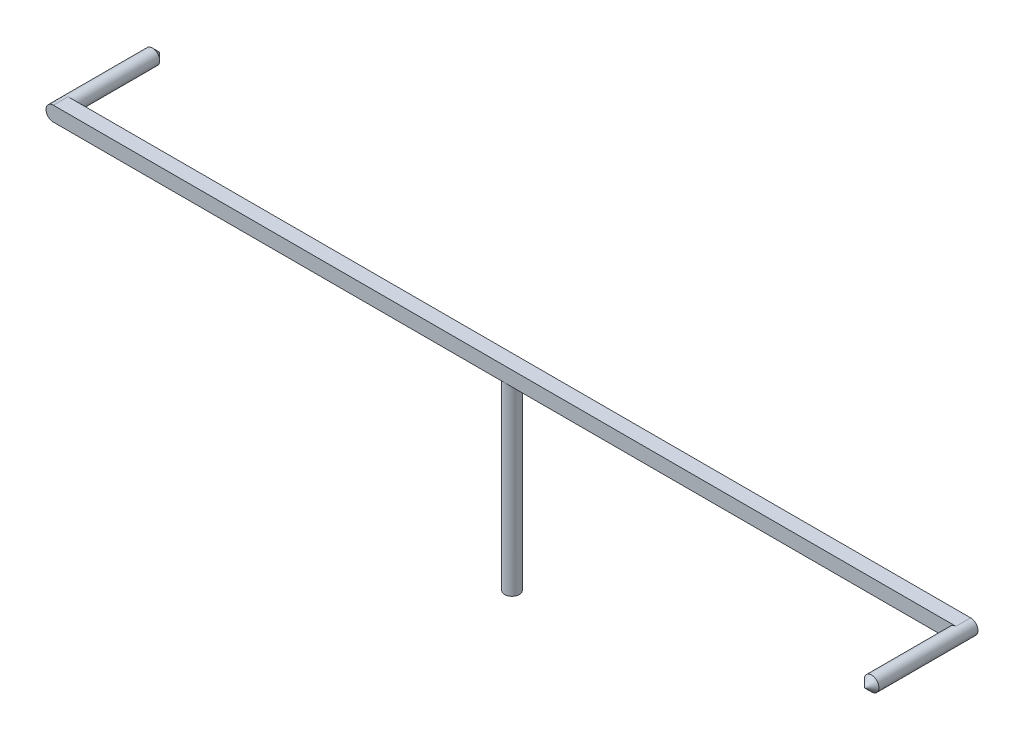
ISO-10303-21;
HEADER;
FILE_DESCRIPTION(('STEP AP214'),'2;1');
FILE_NAME('part.step','',(''),(''),'','','');
FILE_SCHEMA(('AUTOMOTIVE_DESIGN { 1 0 10303 214 1 1 1 1 }'));
ENDSEC;
DATA;
#1=APPLICATION_CONTEXT('core data for automotive mechanical design processes');
#2=APPLICATION_PROTOCOL_DEFINITION('international standard','automotive_design',2000,#1);
#3=PRODUCT_CONTEXT('',#1,'mechanical');
#4=PRODUCT('Part','Part','',(#3));
#5=PRODUCT_RELATED_PRODUCT_CATEGORY('part','',(#4));
#6=PRODUCT_DEFINITION_FORMATION('','',#4);
#7=PRODUCT_DEFINITION_CONTEXT('part definition',#1,'design');
#8=PRODUCT_DEFINITION('design','',#6,#7);
#9=PRODUCT_DEFINITION_SHAPE('','',#8);
#10=(LENGTH_UNIT() NAMED_UNIT(*) SI_UNIT(.MILLI.,.METRE.));
#11=(NAMED_UNIT(*) PLANE_ANGLE_UNIT() SI_UNIT($,.RADIAN.));
#12=(NAMED_UNIT(*) SI_UNIT($,.STERADIAN.) SOLID_ANGLE_UNIT());
#13=UNCERTAINTY_MEASURE_WITH_UNIT(LENGTH_MEASURE(1.E-05),#10,'distance_accuracy_value','');
#14=(GEOMETRIC_REPRESENTATION_CONTEXT(3) GLOBAL_UNCERTAINTY_ASSIGNED_CONTEXT((#13)) GLOBAL_UNIT_ASSIGNED_CONTEXT((#10,
#11,#12)) REPRESENTATION_CONTEXT('',''));
#15=CARTESIAN_POINT('',(0.,0.,0.));
#16=DIRECTION('',(0.,0.,1.));
#17=DIRECTION('',(1.,0.,0.));
#18=AXIS2_PLACEMENT_3D('',#15,#16,#17);
#19=CARTESIAN_POINT('',(0.,10.,0.));
#20=DIRECTION('',(0.,-1.,0.));
#21=DIRECTION('',(0.,0.,-1.));
#22=AXIS2_PLACEMENT_3D('',#19,#20,#21);
#23=CYLINDRICAL_SURFACE('',#22,0.4);
#24=CARTESIAN_POINT('',(0.,10.,0.));
#25=DIRECTION('',(0.,1.,0.));
#26=DIRECTION('',(0.,0.,1.));
#27=AXIS2_PLACEMENT_3D('',#24,#25,#26);
#28=CIRCLE('',#27,0.4);
#29=CARTESIAN_POINT('',(0.,10.,0.4));
#30=VERTEX_POINT('',#29);
#31=CARTESIAN_POINT('',(0.,10.,-0.4));
#32=VERTEX_POINT('',#31);
#33=EDGE_CURVE('E164',#30,#32,#28,.T.);
#34=ORIENTED_EDGE('',*,*,#33,.F.);
#35=EDGE_CURVE('E167',#32,#30,#28,.T.);
#36=ORIENTED_EDGE('',*,*,#35,.F.);
#37=EDGE_LOOP('',(#34,#36));
#38=FACE_BOUND('',#37,.T.);
#39=CARTESIAN_POINT('',(0.,0.,0.));
#40=DIRECTION('',(0.,1.,0.));
#41=DIRECTION('',(0.,0.,1.));
#42=AXIS2_PLACEMENT_3D('',#39,#40,#41);
#43=CIRCLE('',#42,0.4);
#44=CARTESIAN_POINT('',(0.,0.,0.4));
#45=VERTEX_POINT('',#44);
#46=EDGE_CURVE('E153',#45,#45,#43,.T.);
#47=ORIENTED_EDGE('',*,*,#46,.T.);
#48=EDGE_LOOP('',(#47));
#49=FACE_BOUND('',#48,.T.);
#50=ADVANCED_FACE('F35',(#38,#49),#23,.T.);
#51=CARTESIAN_POINT('',(0.,0.,0.));
#52=DIRECTION('',(0.,1.,0.));
#53=DIRECTION('',(0.,0.,1.));
#54=AXIS2_PLACEMENT_3D('',#51,#52,#53);
#55=PLANE('',#54);
#56=ORIENTED_EDGE('',*,*,#46,.F.);
#57=EDGE_LOOP('',(#56));
#58=FACE_BOUND('',#57,.T.);
#59=ADVANCED_FACE('F77',(#58),#55,.F.);
#60=CARTESIAN_POINT('',(0.,10.,0.));
#61=DIRECTION('',(0.,1.,0.));
#62=DIRECTION('',(0.,0.,1.));
#63=AXIS2_PLACEMENT_3D('',#60,#61,#62);
#64=PLANE('',#63);
#65=DIRECTION('',(-1.,0.,0.));
#66=VECTOR('',#65,1.);
#67=CARTESIAN_POINT('',(-25.,10.,-0.4));
#68=LINE('',#67,#66);
#69=CARTESIAN_POINT('',(24.6,10.,-0.4));
#70=VERTEX_POINT('',#69);
#71=EDGE_CURVE('E151',#70,#32,#68,.T.);
#72=ORIENTED_EDGE('',*,*,#71,.F.);
#73=DIRECTION('',(0.,0.,-1.));
#74=VECTOR('',#73,1.);
#75=CARTESIAN_POINT('',(24.6,10.,0.));
#76=LINE('',#75,#74);
#77=CARTESIAN_POINT('',(24.6,10.,0.4));
#78=VERTEX_POINT('',#77);
#79=EDGE_CURVE('E119',#70,#78,#76,.F.);
#80=ORIENTED_EDGE('',*,*,#79,.T.);
#81=DIRECTION('',(1.,0.,0.));
#82=VECTOR('',#81,1.);
#83=CARTESIAN_POINT('',(-25.,10.,0.4));
#84=LINE('',#83,#82);
#85=EDGE_CURVE('E128',#30,#78,#84,.T.);
#86=ORIENTED_EDGE('',*,*,#85,.F.);
#87=ORIENTED_EDGE('',*,*,#33,.T.);
#88=EDGE_LOOP('',(#72,#80,#86,#87));
#89=FACE_BOUND('',#88,.T.);
#90=ADVANCED_FACE('F83',(#89),#64,.F.);
#91=CARTESIAN_POINT('',(-24.6,10.,0.4));
#92=VERTEX_POINT('',#91);
#93=EDGE_CURVE('E161',#92,#30,#84,.T.);
#94=ORIENTED_EDGE('',*,*,#93,.F.);
#95=DIRECTION('',(0.,0.,1.));
#96=VECTOR('',#95,1.);
#97=CARTESIAN_POINT('',(-24.6,10.,0.));
#98=LINE('',#97,#96);
#99=CARTESIAN_POINT('',(-24.6,10.,-0.4));
#100=VERTEX_POINT('',#99);
#101=EDGE_CURVE('E173',#92,#100,#98,.F.);
#102=ORIENTED_EDGE('',*,*,#101,.T.);
#103=EDGE_CURVE('E156',#32,#100,#68,.T.);
#104=ORIENTED_EDGE('',*,*,#103,.F.);
#105=ORIENTED_EDGE('',*,*,#35,.T.);
#106=EDGE_LOOP('',(#94,#102,#104,#105));
#107=FACE_BOUND('',#106,.T.);
#108=ADVANCED_FACE('F179',(#107),#64,.F.);
#109=CARTESIAN_POINT('',(-25.,10.8,0.4));
#110=DIRECTION('',(0.,0.,-1.));
#111=DIRECTION('',(-1.,0.,0.));
#112=AXIS2_PLACEMENT_3D('',#109,#110,#111);
#113=PLANE('',#112);
#114=CARTESIAN_POINT('',(24.6,10.4,0.4));
#115=DIRECTION('',(0.,0.,1.));
#116=DIRECTION('',(1.,0.,0.));
#117=AXIS2_PLACEMENT_3D('',#114,#115,#116);
#118=CIRCLE('',#117,0.399999999999998);
#119=CARTESIAN_POINT('',(24.6,10.8,0.4));
#120=VERTEX_POINT('',#119);
#121=EDGE_CURVE('E108',#120,#78,#118,.T.);
#122=ORIENTED_EDGE('',*,*,#121,.F.);
#123=DIRECTION('',(1.,0.,0.));
#124=VECTOR('',#123,1.);
#125=CARTESIAN_POINT('',(-25.,10.8,0.4));
#126=LINE('',#125,#124);
#127=CARTESIAN_POINT('',(-24.6,10.8,0.4));
#128=VERTEX_POINT('',#127);
#129=EDGE_CURVE('E144',#128,#120,#126,.T.);
#130=ORIENTED_EDGE('',*,*,#129,.F.);
#131=CARTESIAN_POINT('',(-24.6,10.4,0.4));
#132=DIRECTION('',(0.,0.,-1.));
#133=DIRECTION('',(-1.,0.,0.));
#134=AXIS2_PLACEMENT_3D('',#131,#132,#133);
#135=CIRCLE('',#134,0.4);
#136=CARTESIAN_POINT('',(-25.,10.4,0.4));
#137=VERTEX_POINT('',#136);
#138=EDGE_CURVE('E142',#128,#137,#135,.F.);
#139=ORIENTED_EDGE('',*,*,#138,.T.);
#140=CARTESIAN_POINT('',(-24.6,10.4,0.4));
#141=DIRECTION('',(0.,0.,-1.));
#142=DIRECTION('',(-1.,0.,0.));
#143=AXIS2_PLACEMENT_3D('',#140,#141,#142);
#144=CIRCLE('',#143,0.4);
#145=EDGE_CURVE('E171',#137,#92,#144,.F.);
#146=ORIENTED_EDGE('',*,*,#145,.T.);
#147=ORIENTED_EDGE('',*,*,#93,.T.);
#148=ORIENTED_EDGE('',*,*,#85,.T.);
#149=EDGE_LOOP('',(#122,#130,#139,#146,#147,#148));
#150=FACE_BOUND('',#149,.T.);
#151=ADVANCED_FACE('F148',(#150),#113,.F.);
#152=CARTESIAN_POINT('',(-25.,10.8,-0.4));
#153=DIRECTION('',(0.,0.,1.));
#154=DIRECTION('',(1.,0.,0.));
#155=AXIS2_PLACEMENT_3D('',#152,#153,#154);
#156=PLANE('',#155);
#157=CARTESIAN_POINT('',(-24.6,10.4,-0.4));
#158=DIRECTION('',(0.,0.,-1.));
#159=DIRECTION('',(-1.,0.,0.));
#160=AXIS2_PLACEMENT_3D('',#157,#158,#159);
#161=CIRCLE('',#160,0.399999999999998);
#162=CARTESIAN_POINT('',(-24.6,10.8,-0.4));
#163=VERTEX_POINT('',#162);
#164=EDGE_CURVE('E139',#163,#100,#161,.T.);
#165=ORIENTED_EDGE('',*,*,#164,.F.);
#166=DIRECTION('',(-1.,0.,0.));
#167=VECTOR('',#166,1.);
#168=CARTESIAN_POINT('',(-25.,10.8,-0.4));
#169=LINE('',#168,#167);
#170=CARTESIAN_POINT('',(24.6,10.8,-0.4));
#171=VERTEX_POINT('',#170);
#172=EDGE_CURVE('E145',#171,#163,#169,.T.);
#173=ORIENTED_EDGE('',*,*,#172,.F.);
#174=CARTESIAN_POINT('',(24.6,10.4,-0.4));
#175=DIRECTION('',(0.,0.,1.));
#176=DIRECTION('',(1.,0.,0.));
#177=AXIS2_PLACEMENT_3D('',#174,#175,#176);
#178=CIRCLE('',#177,0.4);
#179=CARTESIAN_POINT('',(25.,10.4,-0.4));
#180=VERTEX_POINT('',#179);
#181=EDGE_CURVE('E52',#171,#180,#178,.F.);
#182=ORIENTED_EDGE('',*,*,#181,.T.);
#183=CARTESIAN_POINT('',(24.6,10.4,-0.4));
#184=DIRECTION('',(0.,0.,1.));
#185=DIRECTION('',(1.,0.,0.));
#186=AXIS2_PLACEMENT_3D('',#183,#184,#185);
#187=CIRCLE('',#186,0.4);
#188=EDGE_CURVE('E116',#180,#70,#187,.F.);
#189=ORIENTED_EDGE('',*,*,#188,.T.);
#190=ORIENTED_EDGE('',*,*,#71,.T.);
#191=ORIENTED_EDGE('',*,*,#103,.T.);
#192=EDGE_LOOP('',(#165,#173,#182,#189,#190,#191));
#193=FACE_BOUND('',#192,.T.);
#194=ADVANCED_FACE('F186',(#193),#156,.F.);
#195=CARTESIAN_POINT('',(0.,10.8,0.));
#196=DIRECTION('',(0.,1.,0.));
#197=DIRECTION('',(0.,0.,1.));
#198=AXIS2_PLACEMENT_3D('',#195,#196,#197);
#199=PLANE('',#198);
#200=ORIENTED_EDGE('',*,*,#172,.T.);
#201=DIRECTION('',(0.,0.,1.));
#202=VECTOR('',#201,1.);
#203=CARTESIAN_POINT('',(-24.6,10.8,0.4));
#204=LINE('',#203,#202);
#205=EDGE_CURVE('E115',#163,#128,#204,.T.);
#206=ORIENTED_EDGE('',*,*,#205,.T.);
#207=ORIENTED_EDGE('',*,*,#129,.T.);
#208=DIRECTION('',(0.,0.,-1.));
#209=VECTOR('',#208,1.);
#210=CARTESIAN_POINT('',(24.6,10.8,-0.4));
#211=LINE('',#210,#209);
#212=EDGE_CURVE('E104',#120,#171,#211,.T.);
#213=ORIENTED_EDGE('',*,*,#212,.T.);
#214=EDGE_LOOP('',(#200,#206,#207,#213));
#215=FACE_BOUND('',#214,.T.);
#216=ADVANCED_FACE('F93',(#215),#199,.T.);
#217=CARTESIAN_POINT('',(-24.6,10.4,0.));
#218=DIRECTION('',(0.,0.,-1.));
#219=DIRECTION('',(-1.,0.,0.));
#220=AXIS2_PLACEMENT_3D('',#217,#218,#219);
#221=CYLINDRICAL_SURFACE('',#220,0.4);
#222=CARTESIAN_POINT('',(-24.6,10.4,-4.99999999999999));
#223=DIRECTION('',(0.,0.,-1.));
#224=DIRECTION('',(-1.,0.,0.));
#225=AXIS2_PLACEMENT_3D('',#222,#223,#224);
#226=CIRCLE('',#225,0.4);
#227=CARTESIAN_POINT('',(-25.,10.4,-4.99999999999999));
#228=VERTEX_POINT('',#227);
#229=EDGE_CURVE('E44',#228,#228,#226,.F.);
#230=ORIENTED_EDGE('',*,*,#229,.T.);
#231=EDGE_LOOP('',(#230));
#232=FACE_BOUND('',#231,.T.);
#233=ORIENTED_EDGE('',*,*,#205,.F.);
#234=ORIENTED_EDGE('',*,*,#164,.T.);
#235=ORIENTED_EDGE('',*,*,#101,.F.);
#236=ORIENTED_EDGE('',*,*,#145,.F.);
#237=DIRECTION('',(0.,0.,1.));
#238=VECTOR('',#237,1.);
#239=CARTESIAN_POINT('',(-25.,10.4,-0.4));
#240=LINE('',#239,#238);
#241=CARTESIAN_POINT('',(-25.,10.4,-0.4));
#242=VERTEX_POINT('',#241);
#243=EDGE_CURVE('E126',#137,#242,#240,.F.);
#244=ORIENTED_EDGE('',*,*,#243,.T.);
#245=ORIENTED_EDGE('',*,*,#243,.F.);
#246=ORIENTED_EDGE('',*,*,#138,.F.);
#247=EDGE_LOOP('',(#233,#234,#235,#236,#244,#245,#246));
#248=FACE_BOUND('',#247,.T.);
#249=ADVANCED_FACE('F90',(#232,#248),#221,.T.);
#250=CARTESIAN_POINT('',(24.6,10.4,0.));
#251=DIRECTION('',(0.,0.,1.));
#252=DIRECTION('',(1.,0.,0.));
#253=AXIS2_PLACEMENT_3D('',#250,#251,#252);
#254=CYLINDRICAL_SURFACE('',#253,0.4);
#255=CARTESIAN_POINT('',(24.6,10.4,4.99999999999999));
#256=DIRECTION('',(0.,0.,1.));
#257=DIRECTION('',(1.,0.,0.));
#258=AXIS2_PLACEMENT_3D('',#255,#256,#257);
#259=CIRCLE('',#258,0.4);
#260=CARTESIAN_POINT('',(25.,10.4,4.99999999999999));
#261=VERTEX_POINT('',#260);
#262=EDGE_CURVE('E11',#261,#261,#259,.F.);
#263=ORIENTED_EDGE('',*,*,#262,.T.);
#264=EDGE_LOOP('',(#263));
#265=FACE_BOUND('',#264,.T.);
#266=ORIENTED_EDGE('',*,*,#212,.F.);
#267=ORIENTED_EDGE('',*,*,#121,.T.);
#268=ORIENTED_EDGE('',*,*,#79,.F.);
#269=ORIENTED_EDGE('',*,*,#188,.F.);
#270=DIRECTION('',(0.,0.,-1.));
#271=VECTOR('',#270,1.);
#272=CARTESIAN_POINT('',(25.,10.4,0.4));
#273=LINE('',#272,#271);
#274=CARTESIAN_POINT('',(25.,10.4,0.4));
#275=VERTEX_POINT('',#274);
#276=EDGE_CURVE('E129',#180,#275,#273,.F.);
#277=ORIENTED_EDGE('',*,*,#276,.T.);
#278=ORIENTED_EDGE('',*,*,#276,.F.);
#279=ORIENTED_EDGE('',*,*,#181,.F.);
#280=EDGE_LOOP('',(#266,#267,#268,#269,#277,#278,#279));
#281=FACE_BOUND('',#280,.T.);
#282=ADVANCED_FACE('F73',(#265,#281),#254,.T.);
#283=CARTESIAN_POINT('',(-24.6,10.4,-4.99999999999999));
#284=DIRECTION('',(0.,0.,1.));
#285=DIRECTION('',(1.,0.,0.));
#286=AXIS2_PLACEMENT_3D('',#283,#284,#285);
#287=CONICAL_SURFACE('',#286,0.400000000000015,0.78539816339746);
#288=ORIENTED_EDGE('',*,*,#229,.F.);
#289=EDGE_LOOP('',(#288));
#290=FACE_BOUND('',#289,.T.);
#291=CARTESIAN_POINT('',(-24.6,10.4,-5.4));
#292=VERTEX_POINT('',#291);
#293=VERTEX_LOOP('',#292);
#294=FACE_BOUND('',#293,.T.);
#295=ADVANCED_FACE('F68',(#290,#294),#287,.T.);
#296=CARTESIAN_POINT('',(24.6,10.4,4.99999999999999));
#297=DIRECTION('',(0.,0.,-1.));
#298=DIRECTION('',(-1.,0.,0.));
#299=AXIS2_PLACEMENT_3D('',#296,#297,#298);
#300=CONICAL_SURFACE('',#299,0.400000000000015,0.78539816339746);
#301=ORIENTED_EDGE('',*,*,#262,.F.);
#302=EDGE_LOOP('',(#301));
#303=FACE_BOUND('',#302,.T.);
#304=CARTESIAN_POINT('',(24.6,10.4,5.4));
#305=VERTEX_POINT('',#304);
#306=VERTEX_LOOP('',#305);
#307=FACE_BOUND('',#306,.T.);
#308=ADVANCED_FACE('F37',(#303,#307),#300,.T.);
#309=CLOSED_SHELL('',(#50,#59,#90,#108,#151,#194,#216,#249,#282,#295,#308));
#310=MANIFOLD_SOLID_BREP('B2',#309);
#311=ADVANCED_BREP_SHAPE_REPRESENTATION('',(#18,#310),#14);
#312=SHAPE_DEFINITION_REPRESENTATION(#9,#311);
ENDSEC;
END-ISO-10303-21;
